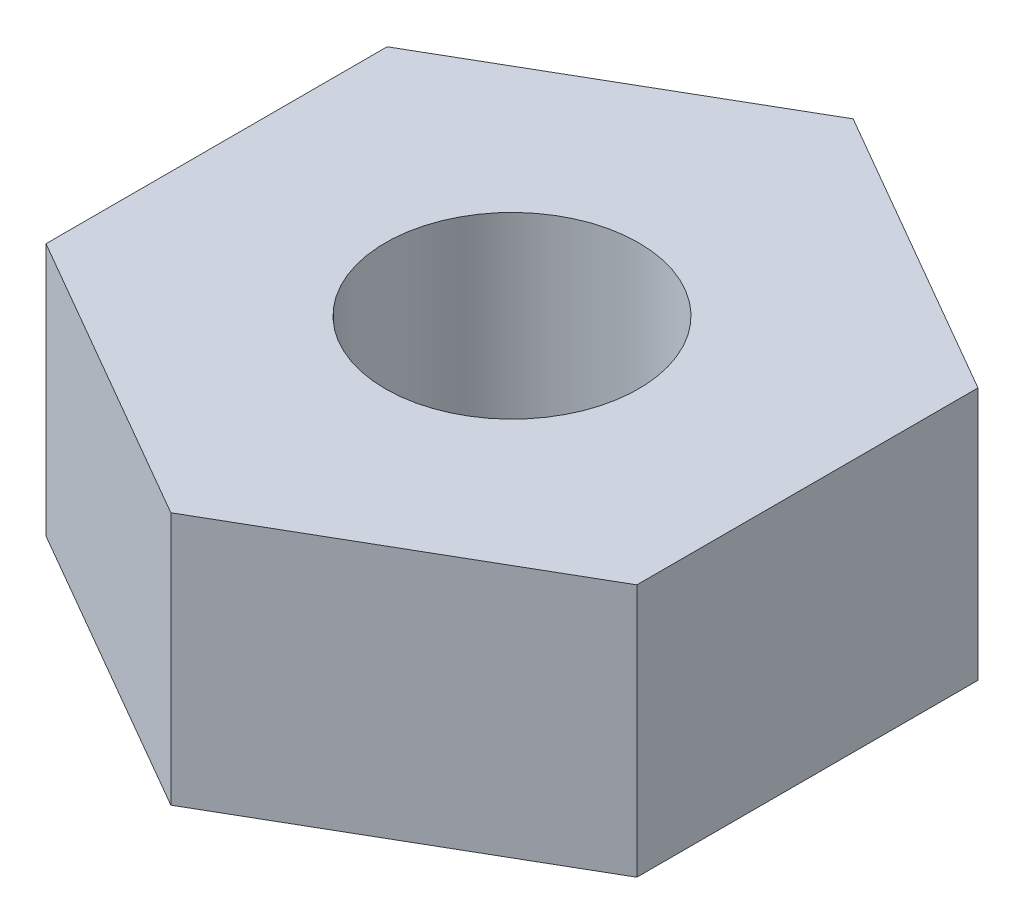
ISO-10303-21;
HEADER;
FILE_DESCRIPTION(('STEP AP214'),'2;1');
FILE_NAME('part.step','',(''),(''),'','','');
FILE_SCHEMA(('AUTOMOTIVE_DESIGN { 1 0 10303 214 1 1 1 1 }'));
ENDSEC;
DATA;
#1=APPLICATION_CONTEXT('core data for automotive mechanical design processes');
#2=APPLICATION_PROTOCOL_DEFINITION('international standard','automotive_design',2000,#1);
#3=PRODUCT_CONTEXT('',#1,'mechanical');
#4=PRODUCT('Part','Part','',(#3));
#5=PRODUCT_RELATED_PRODUCT_CATEGORY('part','',(#4));
#6=PRODUCT_DEFINITION_FORMATION('','',#4);
#7=PRODUCT_DEFINITION_CONTEXT('part definition',#1,'design');
#8=PRODUCT_DEFINITION('design','',#6,#7);
#9=PRODUCT_DEFINITION_SHAPE('','',#8);
#10=(LENGTH_UNIT() NAMED_UNIT(*) SI_UNIT(.MILLI.,.METRE.));
#11=(NAMED_UNIT(*) PLANE_ANGLE_UNIT() SI_UNIT($,.RADIAN.));
#12=(NAMED_UNIT(*) SI_UNIT($,.STERADIAN.) SOLID_ANGLE_UNIT());
#13=UNCERTAINTY_MEASURE_WITH_UNIT(LENGTH_MEASURE(1.E-05),#10,'distance_accuracy_value','');
#14=(GEOMETRIC_REPRESENTATION_CONTEXT(3) GLOBAL_UNCERTAINTY_ASSIGNED_CONTEXT((#13)) GLOBAL_UNIT_ASSIGNED_CONTEXT((#10,
#11,#12)) REPRESENTATION_CONTEXT('',''));
#15=CARTESIAN_POINT('',(0.,0.,0.));
#16=DIRECTION('',(0.,0.,1.));
#17=DIRECTION('',(1.,0.,0.));
#18=AXIS2_PLACEMENT_3D('',#15,#16,#17);
#19=CARTESIAN_POINT('',(3.5,3.,-2.02072594216369));
#20=DIRECTION('',(-0.5,0.,0.866025403784439));
#21=DIRECTION('',(0.866025403784439,0.,0.5));
#22=AXIS2_PLACEMENT_3D('',#19,#20,#21);
#23=PLANE('',#22);
#24=DIRECTION('',(-0.866025403784439,0.,-0.5));
#25=VECTOR('',#24,1.);
#26=CARTESIAN_POINT('',(3.5,0.,-2.02072594216369));
#27=LINE('',#26,#25);
#28=CARTESIAN_POINT('',(3.5,0.,-2.02072594216369));
#29=VERTEX_POINT('',#28);
#30=CARTESIAN_POINT('',(0.,0.,-4.04145188432738));
#31=VERTEX_POINT('',#30);
#32=EDGE_CURVE('E119',#29,#31,#27,.T.);
#33=ORIENTED_EDGE('',*,*,#32,.T.);
#34=DIRECTION('',(0.,-1.,0.));
#35=VECTOR('',#34,1.);
#36=CARTESIAN_POINT('',(0.,3.,-4.04145188432738));
#37=LINE('',#36,#35);
#38=CARTESIAN_POINT('',(0.,3.,-4.04145188432738));
#39=VERTEX_POINT('',#38);
#40=EDGE_CURVE('E11',#39,#31,#37,.T.);
#41=ORIENTED_EDGE('',*,*,#40,.F.);
#42=DIRECTION('',(-0.866025403784439,0.,-0.5));
#43=VECTOR('',#42,1.);
#44=CARTESIAN_POINT('',(3.5,3.,-2.02072594216369));
#45=LINE('',#44,#43);
#46=CARTESIAN_POINT('',(3.5,3.,-2.02072594216369));
#47=VERTEX_POINT('',#46);
#48=EDGE_CURVE('E129',#47,#39,#45,.T.);
#49=ORIENTED_EDGE('',*,*,#48,.F.);
#50=DIRECTION('',(0.,-1.,0.));
#51=VECTOR('',#50,1.);
#52=CARTESIAN_POINT('',(3.5,3.,-2.02072594216369));
#53=LINE('',#52,#51);
#54=EDGE_CURVE('E115',#47,#29,#53,.T.);
#55=ORIENTED_EDGE('',*,*,#54,.T.);
#56=EDGE_LOOP('',(#33,#41,#49,#55));
#57=FACE_BOUND('',#56,.T.);
#58=ADVANCED_FACE('F34',(#57),#23,.F.);
#59=CARTESIAN_POINT('',(0.,3.,-4.04145188432738));
#60=DIRECTION('',(0.5,0.,0.866025403784438));
#61=DIRECTION('',(0.866025403784439,0.,-0.5));
#62=AXIS2_PLACEMENT_3D('',#59,#60,#61);
#63=PLANE('',#62);
#64=DIRECTION('',(-0.866025403784439,0.,0.5));
#65=VECTOR('',#64,1.);
#66=CARTESIAN_POINT('',(0.,0.,-4.04145188432738));
#67=LINE('',#66,#65);
#68=CARTESIAN_POINT('',(-3.5,0.,-2.02072594216369));
#69=VERTEX_POINT('',#68);
#70=EDGE_CURVE('E122',#31,#69,#67,.T.);
#71=ORIENTED_EDGE('',*,*,#70,.T.);
#72=DIRECTION('',(0.,-1.,0.));
#73=VECTOR('',#72,1.);
#74=CARTESIAN_POINT('',(-3.5,3.,-2.02072594216369));
#75=LINE('',#74,#73);
#76=CARTESIAN_POINT('',(-3.5,3.,-2.02072594216369));
#77=VERTEX_POINT('',#76);
#78=EDGE_CURVE('E43',#77,#69,#75,.T.);
#79=ORIENTED_EDGE('',*,*,#78,.F.);
#80=DIRECTION('',(-0.866025403784439,0.,0.5));
#81=VECTOR('',#80,1.);
#82=CARTESIAN_POINT('',(0.,3.,-4.04145188432738));
#83=LINE('',#82,#81);
#84=EDGE_CURVE('E88',#39,#77,#83,.T.);
#85=ORIENTED_EDGE('',*,*,#84,.F.);
#86=ORIENTED_EDGE('',*,*,#40,.T.);
#87=EDGE_LOOP('',(#71,#79,#85,#86));
#88=FACE_BOUND('',#87,.T.);
#89=ADVANCED_FACE('F155',(#88),#63,.F.);
#90=CARTESIAN_POINT('',(-3.5,3.,-2.02072594216369));
#91=DIRECTION('',(1.,0.,0.));
#92=DIRECTION('',(0.,0.,-1.));
#93=AXIS2_PLACEMENT_3D('',#90,#91,#92);
#94=PLANE('',#93);
#95=DIRECTION('',(0.,0.,1.));
#96=VECTOR('',#95,1.);
#97=CARTESIAN_POINT('',(-3.5,0.,-2.02072594216369));
#98=LINE('',#97,#96);
#99=CARTESIAN_POINT('',(-3.5,0.,2.02072594216369));
#100=VERTEX_POINT('',#99);
#101=EDGE_CURVE('E124',#69,#100,#98,.T.);
#102=ORIENTED_EDGE('',*,*,#101,.T.);
#103=DIRECTION('',(0.,-1.,0.));
#104=VECTOR('',#103,1.);
#105=CARTESIAN_POINT('',(-3.5,3.,2.02072594216369));
#106=LINE('',#105,#104);
#107=CARTESIAN_POINT('',(-3.5,3.,2.02072594216369));
#108=VERTEX_POINT('',#107);
#109=EDGE_CURVE('E110',#108,#100,#106,.T.);
#110=ORIENTED_EDGE('',*,*,#109,.F.);
#111=DIRECTION('',(0.,0.,1.));
#112=VECTOR('',#111,1.);
#113=CARTESIAN_POINT('',(-3.5,3.,-2.02072594216369));
#114=LINE('',#113,#112);
#115=EDGE_CURVE('E101',#77,#108,#114,.T.);
#116=ORIENTED_EDGE('',*,*,#115,.F.);
#117=ORIENTED_EDGE('',*,*,#78,.T.);
#118=EDGE_LOOP('',(#102,#110,#116,#117));
#119=FACE_BOUND('',#118,.T.);
#120=ADVANCED_FACE('F136',(#119),#94,.F.);
#121=CARTESIAN_POINT('',(-3.5,3.,2.02072594216369));
#122=DIRECTION('',(0.5,0.,-0.866025403784439));
#123=DIRECTION('',(-0.866025403784439,0.,-0.5));
#124=AXIS2_PLACEMENT_3D('',#121,#122,#123);
#125=PLANE('',#124);
#126=DIRECTION('',(0.866025403784439,0.,0.5));
#127=VECTOR('',#126,1.);
#128=CARTESIAN_POINT('',(-3.5,0.,2.02072594216369));
#129=LINE('',#128,#127);
#130=CARTESIAN_POINT('',(0.,0.,4.04145188432738));
#131=VERTEX_POINT('',#130);
#132=EDGE_CURVE('E109',#100,#131,#129,.T.);
#133=ORIENTED_EDGE('',*,*,#132,.T.);
#134=DIRECTION('',(0.,-1.,0.));
#135=VECTOR('',#134,1.);
#136=CARTESIAN_POINT('',(0.,3.,4.04145188432738));
#137=LINE('',#136,#135);
#138=CARTESIAN_POINT('',(0.,3.,4.04145188432738));
#139=VERTEX_POINT('',#138);
#140=EDGE_CURVE('E106',#139,#131,#137,.T.);
#141=ORIENTED_EDGE('',*,*,#140,.F.);
#142=DIRECTION('',(0.866025403784439,0.,0.5));
#143=VECTOR('',#142,1.);
#144=CARTESIAN_POINT('',(-3.5,3.,2.02072594216369));
#145=LINE('',#144,#143);
#146=EDGE_CURVE('E95',#108,#139,#145,.T.);
#147=ORIENTED_EDGE('',*,*,#146,.F.);
#148=ORIENTED_EDGE('',*,*,#109,.T.);
#149=EDGE_LOOP('',(#133,#141,#147,#148));
#150=FACE_BOUND('',#149,.T.);
#151=ADVANCED_FACE('F107',(#150),#125,.F.);
#152=CARTESIAN_POINT('',(0.,3.,4.04145188432738));
#153=DIRECTION('',(-0.5,0.,-0.866025403784439));
#154=DIRECTION('',(-0.866025403784439,0.,0.5));
#155=AXIS2_PLACEMENT_3D('',#152,#153,#154);
#156=PLANE('',#155);
#157=DIRECTION('',(0.866025403784439,0.,-0.5));
#158=VECTOR('',#157,1.);
#159=CARTESIAN_POINT('',(0.,0.,4.04145188432738));
#160=LINE('',#159,#158);
#161=CARTESIAN_POINT('',(3.5,0.,2.02072594216369));
#162=VERTEX_POINT('',#161);
#163=EDGE_CURVE('E74',#131,#162,#160,.T.);
#164=ORIENTED_EDGE('',*,*,#163,.T.);
#165=DIRECTION('',(0.,-1.,0.));
#166=VECTOR('',#165,1.);
#167=CARTESIAN_POINT('',(3.5,3.,2.02072594216369));
#168=LINE('',#167,#166);
#169=CARTESIAN_POINT('',(3.5,3.,2.02072594216369));
#170=VERTEX_POINT('',#169);
#171=EDGE_CURVE('E111',#170,#162,#168,.T.);
#172=ORIENTED_EDGE('',*,*,#171,.F.);
#173=DIRECTION('',(0.866025403784439,0.,-0.5));
#174=VECTOR('',#173,1.);
#175=CARTESIAN_POINT('',(0.,3.,4.04145188432738));
#176=LINE('',#175,#174);
#177=EDGE_CURVE('E99',#139,#170,#176,.T.);
#178=ORIENTED_EDGE('',*,*,#177,.F.);
#179=ORIENTED_EDGE('',*,*,#140,.T.);
#180=EDGE_LOOP('',(#164,#172,#178,#179));
#181=FACE_BOUND('',#180,.T.);
#182=ADVANCED_FACE('F113',(#181),#156,.F.);
#183=CARTESIAN_POINT('',(3.5,3.,2.02072594216369));
#184=DIRECTION('',(-1.,0.,0.));
#185=DIRECTION('',(0.,0.,1.));
#186=AXIS2_PLACEMENT_3D('',#183,#184,#185);
#187=PLANE('',#186);
#188=DIRECTION('',(0.,0.,-1.));
#189=VECTOR('',#188,1.);
#190=CARTESIAN_POINT('',(3.5,0.,2.02072594216369));
#191=LINE('',#190,#189);
#192=EDGE_CURVE('E80',#162,#29,#191,.T.);
#193=ORIENTED_EDGE('',*,*,#192,.T.);
#194=ORIENTED_EDGE('',*,*,#54,.F.);
#195=DIRECTION('',(0.,0.,-1.));
#196=VECTOR('',#195,1.);
#197=CARTESIAN_POINT('',(3.5,3.,2.02072594216369));
#198=LINE('',#197,#196);
#199=EDGE_CURVE('E51',#170,#47,#198,.T.);
#200=ORIENTED_EDGE('',*,*,#199,.F.);
#201=ORIENTED_EDGE('',*,*,#171,.T.);
#202=EDGE_LOOP('',(#193,#194,#200,#201));
#203=FACE_BOUND('',#202,.T.);
#204=ADVANCED_FACE('F143',(#203),#187,.F.);
#205=CARTESIAN_POINT('',(0.,3.,0.));
#206=DIRECTION('',(0.,1.,0.));
#207=DIRECTION('',(0.,0.,1.));
#208=AXIS2_PLACEMENT_3D('',#205,#206,#207);
#209=PLANE('',#208);
#210=CARTESIAN_POINT('',(0.,3.,0.));
#211=DIRECTION('',(0.,1.,0.));
#212=DIRECTION('',(0.,0.,1.));
#213=AXIS2_PLACEMENT_3D('',#210,#211,#212);
#214=CIRCLE('',#213,1.5);
#215=CARTESIAN_POINT('',(0.,3.,1.5));
#216=VERTEX_POINT('',#215);
#217=EDGE_CURVE('E208',#216,#216,#214,.T.);
#218=ORIENTED_EDGE('',*,*,#217,.F.);
#219=EDGE_LOOP('',(#218));
#220=FACE_BOUND('',#219,.T.);
#221=ORIENTED_EDGE('',*,*,#48,.T.);
#222=ORIENTED_EDGE('',*,*,#84,.T.);
#223=ORIENTED_EDGE('',*,*,#115,.T.);
#224=ORIENTED_EDGE('',*,*,#146,.T.);
#225=ORIENTED_EDGE('',*,*,#177,.T.);
#226=ORIENTED_EDGE('',*,*,#199,.T.);
#227=EDGE_LOOP('',(#221,#222,#223,#224,#225,#226));
#228=FACE_BOUND('',#227,.T.);
#229=ADVANCED_FACE('F97',(#220,#228),#209,.T.);
#230=CARTESIAN_POINT('',(0.,0.,0.));
#231=DIRECTION('',(0.,1.,0.));
#232=DIRECTION('',(0.,0.,1.));
#233=AXIS2_PLACEMENT_3D('',#230,#231,#232);
#234=PLANE('',#233);
#235=CARTESIAN_POINT('',(0.,0.,0.));
#236=DIRECTION('',(0.,1.,0.));
#237=DIRECTION('',(0.,0.,1.));
#238=AXIS2_PLACEMENT_3D('',#235,#236,#237);
#239=CIRCLE('',#238,1.5);
#240=CARTESIAN_POINT('',(0.,0.,1.5));
#241=VERTEX_POINT('',#240);
#242=EDGE_CURVE('E37',#241,#241,#239,.T.);
#243=ORIENTED_EDGE('',*,*,#242,.T.);
#244=EDGE_LOOP('',(#243));
#245=FACE_BOUND('',#244,.T.);
#246=ORIENTED_EDGE('',*,*,#32,.F.);
#247=ORIENTED_EDGE('',*,*,#192,.F.);
#248=ORIENTED_EDGE('',*,*,#163,.F.);
#249=ORIENTED_EDGE('',*,*,#132,.F.);
#250=ORIENTED_EDGE('',*,*,#101,.F.);
#251=ORIENTED_EDGE('',*,*,#70,.F.);
#252=EDGE_LOOP('',(#246,#247,#248,#249,#250,#251));
#253=FACE_BOUND('',#252,.T.);
#254=ADVANCED_FACE('F139',(#245,#253),#234,.F.);
#255=CARTESIAN_POINT('',(0.,-2.5,0.));
#256=DIRECTION('',(0.,1.,0.));
#257=DIRECTION('',(0.,0.,1.));
#258=AXIS2_PLACEMENT_3D('',#255,#256,#257);
#259=CYLINDRICAL_SURFACE('',#258,1.5);
#260=ORIENTED_EDGE('',*,*,#217,.T.);
#261=EDGE_LOOP('',(#260));
#262=FACE_BOUND('',#261,.T.);
#263=ORIENTED_EDGE('',*,*,#242,.F.);
#264=EDGE_LOOP('',(#263));
#265=FACE_BOUND('',#264,.T.);
#266=ADVANCED_FACE('F192',(#262,#265),#259,.F.);
#267=CLOSED_SHELL('',(#58,#89,#120,#151,#182,#204,#229,#254,#266));
#268=MANIFOLD_SOLID_BREP('B2',#267);
#269=ADVANCED_BREP_SHAPE_REPRESENTATION('',(#18,#268),#14);
#270=SHAPE_DEFINITION_REPRESENTATION(#9,#269);
ENDSEC;
END-ISO-10303-21;
